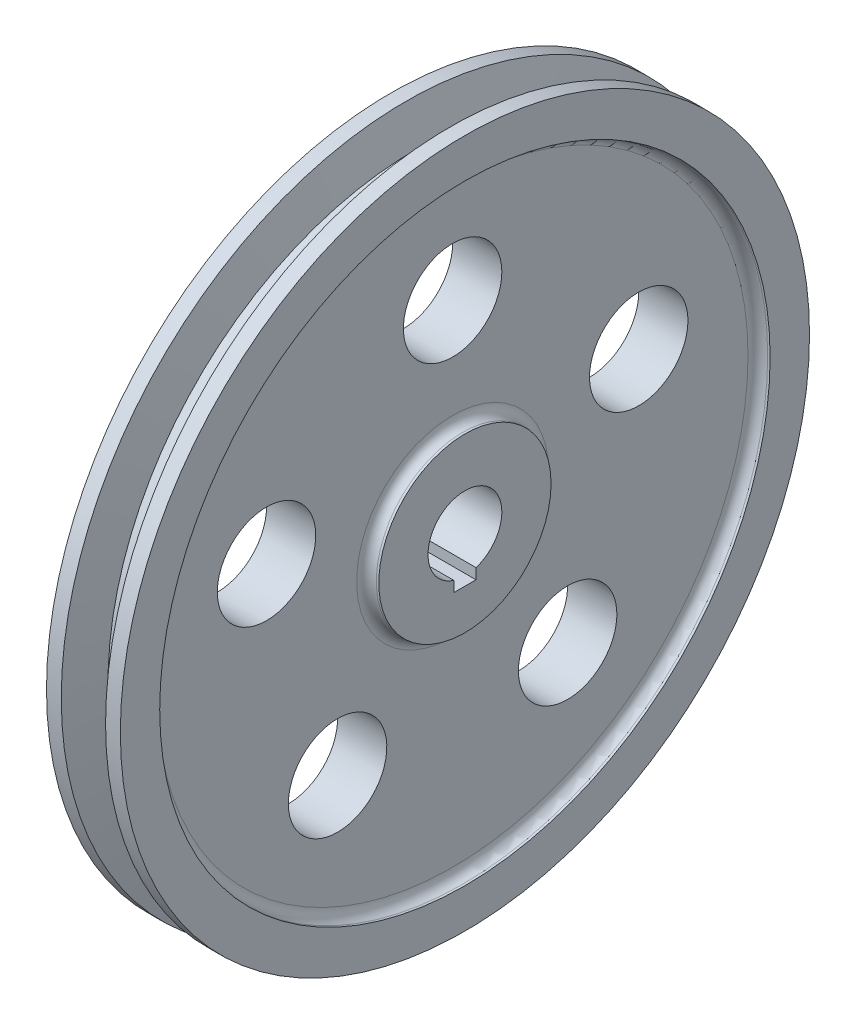
ISO-10303-21;
HEADER;
FILE_DESCRIPTION(('STEP AP214'),'2;1');
FILE_NAME('part.step','',(''),(''),'','','');
FILE_SCHEMA(('AUTOMOTIVE_DESIGN { 1 0 10303 214 1 1 1 1 }'));
ENDSEC;
DATA;
#1=APPLICATION_CONTEXT('core data for automotive mechanical design processes');
#2=APPLICATION_PROTOCOL_DEFINITION('international standard','automotive_design',2000,#1);
#3=PRODUCT_CONTEXT('',#1,'mechanical');
#4=PRODUCT('Part','Part','',(#3));
#5=PRODUCT_RELATED_PRODUCT_CATEGORY('part','',(#4));
#6=PRODUCT_DEFINITION_FORMATION('','',#4);
#7=PRODUCT_DEFINITION_CONTEXT('part definition',#1,'design');
#8=PRODUCT_DEFINITION('design','',#6,#7);
#9=PRODUCT_DEFINITION_SHAPE('','',#8);
#10=(LENGTH_UNIT() NAMED_UNIT(*) SI_UNIT(.MILLI.,.METRE.));
#11=(NAMED_UNIT(*) PLANE_ANGLE_UNIT() SI_UNIT($,.RADIAN.));
#12=(NAMED_UNIT(*) SI_UNIT($,.STERADIAN.) SOLID_ANGLE_UNIT());
#13=UNCERTAINTY_MEASURE_WITH_UNIT(LENGTH_MEASURE(1.E-05),#10,'distance_accuracy_value','');
#14=(GEOMETRIC_REPRESENTATION_CONTEXT(3) GLOBAL_UNCERTAINTY_ASSIGNED_CONTEXT((#13)) GLOBAL_UNIT_ASSIGNED_CONTEXT((#10,
#11,#12)) REPRESENTATION_CONTEXT('',''));
#15=CARTESIAN_POINT('',(0.,0.,0.));
#16=DIRECTION('',(0.,0.,1.));
#17=DIRECTION('',(1.,0.,0.));
#18=AXIS2_PLACEMENT_3D('',#15,#16,#17);
#19=CARTESIAN_POINT('',(-7.5,7.5,0.));
#20=DIRECTION('',(-1.,0.,0.));
#21=DIRECTION('',(0.,0.,1.));
#22=AXIS2_PLACEMENT_3D('',#19,#20,#21);
#23=PLANE('',#22);
#24=DIRECTION('',(0.,-1.,0.));
#25=VECTOR('',#24,1.);
#26=CARTESIAN_POINT('',(-7.5,-7.,2.25));
#27=LINE('',#26,#25);
#28=CARTESIAN_POINT('',(-7.5,-7.15454401062709,2.25));
#29=VERTEX_POINT('',#28);
#30=CARTESIAN_POINT('',(-7.5,-9.3,2.25));
#31=VERTEX_POINT('',#30);
#32=EDGE_CURVE('E51',#29,#31,#27,.T.);
#33=ORIENTED_EDGE('',*,*,#32,.T.);
#34=DIRECTION('',(0.,0.,-1.));
#35=VECTOR('',#34,1.);
#36=CARTESIAN_POINT('',(-7.5,-9.3,2.25));
#37=LINE('',#36,#35);
#38=CARTESIAN_POINT('',(-7.5,-9.3,-2.25));
#39=VERTEX_POINT('',#38);
#40=EDGE_CURVE('E75',#31,#39,#37,.T.);
#41=ORIENTED_EDGE('',*,*,#40,.T.);
#42=DIRECTION('',(0.,1.,0.));
#43=VECTOR('',#42,1.);
#44=CARTESIAN_POINT('',(-7.5,-7.,-2.25));
#45=LINE('',#44,#43);
#46=CARTESIAN_POINT('',(-7.5,-7.15454401062709,-2.25));
#47=VERTEX_POINT('',#46);
#48=EDGE_CURVE('E72',#39,#47,#45,.T.);
#49=ORIENTED_EDGE('',*,*,#48,.T.);
#50=CARTESIAN_POINT('',(-7.5,0.,0.));
#51=DIRECTION('',(1.,0.,0.));
#52=DIRECTION('',(0.,0.,-1.));
#53=AXIS2_PLACEMENT_3D('',#50,#51,#52);
#54=CIRCLE('',#53,7.5);
#55=EDGE_CURVE('E38',#47,#29,#54,.T.);
#56=ORIENTED_EDGE('',*,*,#55,.T.);
#57=EDGE_LOOP('',(#33,#41,#49,#56));
#58=FACE_BOUND('',#57,.T.);
#59=CARTESIAN_POINT('',(-7.5,0.,0.));
#60=DIRECTION('',(1.,0.,0.));
#61=DIRECTION('',(0.,0.,-1.));
#62=AXIS2_PLACEMENT_3D('',#59,#60,#61);
#63=CIRCLE('',#62,17.5);
#64=CARTESIAN_POINT('',(-7.5,0.,-17.5));
#65=VERTEX_POINT('',#64);
#66=EDGE_CURVE('E124',#65,#65,#63,.T.);
#67=ORIENTED_EDGE('',*,*,#66,.F.);
#68=EDGE_LOOP('',(#67));
#69=FACE_BOUND('',#68,.T.);
#70=ADVANCED_FACE('F31',(#58,#69),#23,.T.);
#71=CARTESIAN_POINT('',(25.8640372963672,0.,0.));
#72=DIRECTION('',(1.,0.,0.));
#73=DIRECTION('',(0.,0.,-1.));
#74=AXIS2_PLACEMENT_3D('',#71,#72,#73);
#75=CYLINDRICAL_SURFACE('',#74,7.5);
#76=DIRECTION('',(1.,0.,0.));
#77=VECTOR('',#76,1.);
#78=CARTESIAN_POINT('',(25.8640372963672,-7.15454401062709,2.25));
#79=LINE('',#78,#77);
#80=CARTESIAN_POINT('',(7.5,-7.15454401062709,2.25));
#81=VERTEX_POINT('',#80);
#82=EDGE_CURVE('E94',#29,#81,#79,.T.);
#83=ORIENTED_EDGE('',*,*,#82,.F.);
#84=ORIENTED_EDGE('',*,*,#55,.F.);
#85=DIRECTION('',(1.,0.,0.));
#86=VECTOR('',#85,1.);
#87=CARTESIAN_POINT('',(25.8640372963672,-7.15454401062709,-2.25));
#88=LINE('',#87,#86);
#89=CARTESIAN_POINT('',(7.5,-7.15454401062709,-2.25));
#90=VERTEX_POINT('',#89);
#91=EDGE_CURVE('E91',#90,#47,#88,.F.);
#92=ORIENTED_EDGE('',*,*,#91,.F.);
#93=CARTESIAN_POINT('',(7.5,0.,0.));
#94=DIRECTION('',(1.,0.,0.));
#95=DIRECTION('',(0.,0.,-1.));
#96=AXIS2_PLACEMENT_3D('',#93,#94,#95);
#97=CIRCLE('',#96,7.5);
#98=EDGE_CURVE('E180',#90,#81,#97,.T.);
#99=ORIENTED_EDGE('',*,*,#98,.T.);
#100=EDGE_LOOP('',(#83,#84,#92,#99));
#101=FACE_BOUND('',#100,.T.);
#102=ADVANCED_FACE('F185',(#101),#75,.F.);
#103=CARTESIAN_POINT('',(7.5,7.5,0.));
#104=DIRECTION('',(1.,0.,0.));
#105=DIRECTION('',(0.,0.,-1.));
#106=AXIS2_PLACEMENT_3D('',#103,#104,#105);
#107=PLANE('',#106);
#108=DIRECTION('',(0.,-1.,0.));
#109=VECTOR('',#108,1.);
#110=CARTESIAN_POINT('',(7.5,7.5,2.25));
#111=LINE('',#110,#109);
#112=CARTESIAN_POINT('',(7.5,-9.3,2.25));
#113=VERTEX_POINT('',#112);
#114=EDGE_CURVE('E11',#81,#113,#111,.T.);
#115=ORIENTED_EDGE('',*,*,#114,.F.);
#116=ORIENTED_EDGE('',*,*,#98,.F.);
#117=DIRECTION('',(0.,1.,0.));
#118=VECTOR('',#117,1.);
#119=CARTESIAN_POINT('',(7.5,-7.,-2.25));
#120=LINE('',#119,#118);
#121=CARTESIAN_POINT('',(7.5,-9.3,-2.25));
#122=VERTEX_POINT('',#121);
#123=EDGE_CURVE('E84',#122,#90,#120,.T.);
#124=ORIENTED_EDGE('',*,*,#123,.F.);
#125=DIRECTION('',(0.,0.,-1.));
#126=VECTOR('',#125,1.);
#127=CARTESIAN_POINT('',(7.5,-9.3,2.25));
#128=LINE('',#127,#126);
#129=EDGE_CURVE('E86',#113,#122,#128,.T.);
#130=ORIENTED_EDGE('',*,*,#129,.F.);
#131=EDGE_LOOP('',(#115,#116,#124,#130));
#132=FACE_BOUND('',#131,.T.);
#133=CARTESIAN_POINT('',(7.5,0.,0.));
#134=DIRECTION('',(1.,0.,0.));
#135=DIRECTION('',(0.,0.,-1.));
#136=AXIS2_PLACEMENT_3D('',#133,#134,#135);
#137=CIRCLE('',#136,17.5);
#138=CARTESIAN_POINT('',(7.5,0.,-17.5));
#139=VERTEX_POINT('',#138);
#140=EDGE_CURVE('E177',#139,#139,#137,.T.);
#141=ORIENTED_EDGE('',*,*,#140,.T.);
#142=EDGE_LOOP('',(#141));
#143=FACE_BOUND('',#142,.T.);
#144=ADVANCED_FACE('F188',(#132,#143),#107,.T.);
#145=CARTESIAN_POINT('',(25.8640372963672,0.,0.));
#146=DIRECTION('',(1.,0.,0.));
#147=DIRECTION('',(0.,0.,-1.));
#148=AXIS2_PLACEMENT_3D('',#145,#146,#147);
#149=CYLINDRICAL_SURFACE('',#148,17.5);
#150=CARTESIAN_POINT('',(7.,0.,0.));
#151=DIRECTION('',(1.,0.,0.));
#152=DIRECTION('',(0.,0.,-1.));
#153=AXIS2_PLACEMENT_3D('',#150,#151,#152);
#154=CIRCLE('',#153,17.5);
#155=CARTESIAN_POINT('',(7.,0.,-17.5));
#156=VERTEX_POINT('',#155);
#157=EDGE_CURVE('E174',#156,#156,#154,.T.);
#158=ORIENTED_EDGE('',*,*,#157,.T.);
#159=EDGE_LOOP('',(#158));
#160=FACE_BOUND('',#159,.T.);
#161=ORIENTED_EDGE('',*,*,#140,.F.);
#162=EDGE_LOOP('',(#161));
#163=FACE_BOUND('',#162,.T.);
#164=ADVANCED_FACE('F208',(#160,#163),#149,.T.);
#165=CARTESIAN_POINT('',(7.,0.,0.));
#166=DIRECTION('',(1.,0.,0.));
#167=DIRECTION('',(0.,0.,-1.));
#168=AXIS2_PLACEMENT_3D('',#165,#166,#167);
#169=TOROIDAL_SURFACE('',#168,19.5,2.);
#170=CARTESIAN_POINT('',(5.,0.,0.));
#171=DIRECTION('',(1.,0.,0.));
#172=DIRECTION('',(0.,0.,-1.));
#173=AXIS2_PLACEMENT_3D('',#170,#171,#172);
#174=CIRCLE('',#173,19.5);
#175=CARTESIAN_POINT('',(5.,0.,-19.5));
#176=VERTEX_POINT('',#175);
#177=EDGE_CURVE('E171',#176,#176,#174,.T.);
#178=ORIENTED_EDGE('',*,*,#177,.T.);
#179=EDGE_LOOP('',(#178));
#180=FACE_BOUND('',#179,.T.);
#181=ORIENTED_EDGE('',*,*,#157,.F.);
#182=EDGE_LOOP('',(#181));
#183=FACE_BOUND('',#182,.T.);
#184=ADVANCED_FACE('F213',(#180,#183),#169,.F.);
#185=CARTESIAN_POINT('',(5.,19.5,0.));
#186=DIRECTION('',(1.,0.,0.));
#187=DIRECTION('',(0.,0.,-1.));
#188=AXIS2_PLACEMENT_3D('',#185,#186,#187);
#189=PLANE('',#188);
#190=CARTESIAN_POINT('',(5.,12.2834255264046,37.8044965227322));
#191=DIRECTION('',(1.,0.,0.));
#192=DIRECTION('',(0.,0.95105651629515,-0.309016994374958));
#193=AXIS2_PLACEMENT_3D('',#190,#191,#192);
#194=CIRCLE('',#193,10.);
#195=CARTESIAN_POINT('',(5.,21.7939906893561,34.7143265789826));
#196=VERTEX_POINT('',#195);
#197=EDGE_CURVE('E96',#196,#196,#194,.T.);
#198=ORIENTED_EDGE('',*,*,#197,.F.);
#199=EDGE_LOOP('',(#198));
#200=FACE_BOUND('',#199,.T.);
#201=CARTESIAN_POINT('',(5.,-32.158425526404,23.3644637786261));
#202=DIRECTION('',(1.,0.,0.));
#203=DIRECTION('',(0.,0.58778525229248,0.809016994374942));
#204=AXIS2_PLACEMENT_3D('',#201,#202,#203);
#205=CIRCLE('',#204,10.);
#206=CARTESIAN_POINT('',(5.,-26.2805730034792,31.4546337223755));
#207=VERTEX_POINT('',#206);
#208=EDGE_CURVE('E100',#207,#207,#205,.T.);
#209=ORIENTED_EDGE('',*,*,#208,.F.);
#210=EDGE_LOOP('',(#209));
#211=FACE_BOUND('',#210,.T.);
#212=CARTESIAN_POINT('',(5.,-32.1584255264043,-23.3644637786256));
#213=DIRECTION('',(1.,0.,0.));
#214=DIRECTION('',(0.,-0.587785252292469,0.809016994374951));
#215=AXIS2_PLACEMENT_3D('',#212,#213,#214);
#216=CIRCLE('',#215,10.);
#217=CARTESIAN_POINT('',(5.,-38.036278049329,-15.2742938348761));
#218=VERTEX_POINT('',#217);
#219=EDGE_CURVE('E106',#218,#218,#216,.T.);
#220=ORIENTED_EDGE('',*,*,#219,.F.);
#221=EDGE_LOOP('',(#220));
#222=FACE_BOUND('',#221,.T.);
#223=CARTESIAN_POINT('',(5.,12.2834255264041,-37.8044965227324));
#224=DIRECTION('',(1.,0.,0.));
#225=DIRECTION('',(0.,-0.951056516295155,-0.309016994374945));
#226=AXIS2_PLACEMENT_3D('',#223,#224,#225);
#227=CIRCLE('',#226,10.);
#228=CARTESIAN_POINT('',(5.,2.7728603634525,-40.8946664664819));
#229=VERTEX_POINT('',#228);
#230=EDGE_CURVE('E112',#229,#229,#227,.T.);
#231=ORIENTED_EDGE('',*,*,#230,.F.);
#232=EDGE_LOOP('',(#231));
#233=FACE_BOUND('',#232,.T.);
#234=CARTESIAN_POINT('',(5.,39.75,0.));
#235=DIRECTION('',(1.,0.,0.));
#236=DIRECTION('',(0.,0.,-1.));
#237=AXIS2_PLACEMENT_3D('',#234,#235,#236);
#238=CIRCLE('',#237,10.);
#239=CARTESIAN_POINT('',(5.,39.75,-10.));
#240=VERTEX_POINT('',#239);
#241=EDGE_CURVE('E118',#240,#240,#238,.T.);
#242=ORIENTED_EDGE('',*,*,#241,.F.);
#243=EDGE_LOOP('',(#242));
#244=FACE_BOUND('',#243,.T.);
#245=CARTESIAN_POINT('',(5.,0.,0.));
#246=DIRECTION('',(1.,0.,0.));
#247=DIRECTION('',(0.,0.,-1.));
#248=AXIS2_PLACEMENT_3D('',#245,#246,#247);
#249=CIRCLE('',#248,60.);
#250=CARTESIAN_POINT('',(5.,0.,-60.));
#251=VERTEX_POINT('',#250);
#252=EDGE_CURVE('E168',#251,#251,#249,.T.);
#253=ORIENTED_EDGE('',*,*,#252,.T.);
#254=EDGE_LOOP('',(#253));
#255=FACE_BOUND('',#254,.T.);
#256=ORIENTED_EDGE('',*,*,#177,.F.);
#257=EDGE_LOOP('',(#256));
#258=FACE_BOUND('',#257,.T.);
#259=ADVANCED_FACE('F217',(#200,#211,#222,#233,#244,#255,#258),#189,.T.);
#260=CARTESIAN_POINT('',(7.,0.,0.));
#261=DIRECTION('',(1.,0.,0.));
#262=DIRECTION('',(0.,0.,-1.));
#263=AXIS2_PLACEMENT_3D('',#260,#261,#262);
#264=TOROIDAL_SURFACE('',#263,60.,2.);
#265=CARTESIAN_POINT('',(7.,0.,0.));
#266=DIRECTION('',(1.,0.,0.));
#267=DIRECTION('',(0.,0.,-1.));
#268=AXIS2_PLACEMENT_3D('',#265,#266,#267);
#269=CIRCLE('',#268,62.);
#270=CARTESIAN_POINT('',(7.,0.,-62.));
#271=VERTEX_POINT('',#270);
#272=EDGE_CURVE('E165',#271,#271,#269,.T.);
#273=ORIENTED_EDGE('',*,*,#272,.T.);
#274=EDGE_LOOP('',(#273));
#275=FACE_BOUND('',#274,.T.);
#276=ORIENTED_EDGE('',*,*,#252,.F.);
#277=EDGE_LOOP('',(#276));
#278=FACE_BOUND('',#277,.T.);
#279=ADVANCED_FACE('F221',(#275,#278),#264,.F.);
#280=CARTESIAN_POINT('',(25.8640372963672,0.,0.));
#281=DIRECTION('',(1.,0.,0.));
#282=DIRECTION('',(0.,0.,-1.));
#283=AXIS2_PLACEMENT_3D('',#280,#281,#282);
#284=CYLINDRICAL_SURFACE('',#283,62.);
#285=CARTESIAN_POINT('',(7.5,0.,0.));
#286=DIRECTION('',(1.,0.,0.));
#287=DIRECTION('',(0.,0.,-1.));
#288=AXIS2_PLACEMENT_3D('',#285,#286,#287);
#289=CIRCLE('',#288,62.);
#290=CARTESIAN_POINT('',(7.5,0.,-62.));
#291=VERTEX_POINT('',#290);
#292=EDGE_CURVE('E162',#291,#291,#289,.T.);
#293=ORIENTED_EDGE('',*,*,#292,.T.);
#294=EDGE_LOOP('',(#293));
#295=FACE_BOUND('',#294,.T.);
#296=ORIENTED_EDGE('',*,*,#272,.F.);
#297=EDGE_LOOP('',(#296));
#298=FACE_BOUND('',#297,.T.);
#299=ADVANCED_FACE('F225',(#295,#298),#284,.F.);
#300=CARTESIAN_POINT('',(7.5,62.,0.));
#301=DIRECTION('',(1.,0.,0.));
#302=DIRECTION('',(0.,0.,-1.));
#303=AXIS2_PLACEMENT_3D('',#300,#301,#302);
#304=PLANE('',#303);
#305=CARTESIAN_POINT('',(7.5,0.,0.));
#306=DIRECTION('',(1.,0.,0.));
#307=DIRECTION('',(0.,0.,-1.));
#308=AXIS2_PLACEMENT_3D('',#305,#306,#307);
#309=CIRCLE('',#308,70.);
#310=CARTESIAN_POINT('',(7.5,0.,-70.));
#311=VERTEX_POINT('',#310);
#312=EDGE_CURVE('E159',#311,#311,#309,.T.);
#313=ORIENTED_EDGE('',*,*,#312,.T.);
#314=EDGE_LOOP('',(#313));
#315=FACE_BOUND('',#314,.T.);
#316=ORIENTED_EDGE('',*,*,#292,.F.);
#317=EDGE_LOOP('',(#316));
#318=FACE_BOUND('',#317,.T.);
#319=ADVANCED_FACE('F229',(#315,#318),#304,.T.);
#320=CARTESIAN_POINT('',(25.8640372963672,0.,0.));
#321=DIRECTION('',(1.,0.,0.));
#322=DIRECTION('',(0.,0.,-1.));
#323=AXIS2_PLACEMENT_3D('',#320,#321,#322);
#324=CYLINDRICAL_SURFACE('',#323,70.);
#325=CARTESIAN_POINT('',(4.5,0.,0.));
#326=DIRECTION('',(1.,0.,0.));
#327=DIRECTION('',(0.,0.,-1.));
#328=AXIS2_PLACEMENT_3D('',#325,#326,#327);
#329=CIRCLE('',#328,70.);
#330=CARTESIAN_POINT('',(4.5,0.,-70.));
#331=VERTEX_POINT('',#330);
#332=EDGE_CURVE('E156',#331,#331,#329,.T.);
#333=ORIENTED_EDGE('',*,*,#332,.T.);
#334=EDGE_LOOP('',(#333));
#335=FACE_BOUND('',#334,.T.);
#336=ORIENTED_EDGE('',*,*,#312,.F.);
#337=EDGE_LOOP('',(#336));
#338=FACE_BOUND('',#337,.T.);
#339=ADVANCED_FACE('F233',(#335,#338),#324,.T.);
#340=CARTESIAN_POINT('',(4.5,0.,0.));
#341=DIRECTION('',(1.,0.,0.));
#342=DIRECTION('',(0.,0.,-1.));
#343=AXIS2_PLACEMENT_3D('',#340,#341,#342);
#344=CONICAL_SURFACE('',#343,70.,1.31019393504756);
#345=CARTESIAN_POINT('',(2.5,0.,0.));
#346=DIRECTION('',(1.,0.,0.));
#347=DIRECTION('',(0.,0.,-1.));
#348=AXIS2_PLACEMENT_3D('',#345,#346,#347);
#349=CIRCLE('',#348,62.5);
#350=CARTESIAN_POINT('',(2.5,0.,-62.5));
#351=VERTEX_POINT('',#350);
#352=EDGE_CURVE('E153',#351,#351,#349,.T.);
#353=ORIENTED_EDGE('',*,*,#352,.T.);
#354=EDGE_LOOP('',(#353));
#355=FACE_BOUND('',#354,.T.);
#356=ORIENTED_EDGE('',*,*,#332,.F.);
#357=EDGE_LOOP('',(#356));
#358=FACE_BOUND('',#357,.T.);
#359=ADVANCED_FACE('F237',(#355,#358),#344,.T.);
#360=CARTESIAN_POINT('',(25.8640372963672,0.,0.));
#361=DIRECTION('',(1.,0.,0.));
#362=DIRECTION('',(0.,0.,-1.));
#363=AXIS2_PLACEMENT_3D('',#360,#361,#362);
#364=CYLINDRICAL_SURFACE('',#363,62.5);
#365=CARTESIAN_POINT('',(-2.5,0.,0.));
#366=DIRECTION('',(1.,0.,0.));
#367=DIRECTION('',(0.,0.,-1.));
#368=AXIS2_PLACEMENT_3D('',#365,#366,#367);
#369=CIRCLE('',#368,62.5);
#370=CARTESIAN_POINT('',(-2.5,0.,-62.5));
#371=VERTEX_POINT('',#370);
#372=EDGE_CURVE('E150',#371,#371,#369,.T.);
#373=ORIENTED_EDGE('',*,*,#372,.T.);
#374=EDGE_LOOP('',(#373));
#375=FACE_BOUND('',#374,.T.);
#376=ORIENTED_EDGE('',*,*,#352,.F.);
#377=EDGE_LOOP('',(#376));
#378=FACE_BOUND('',#377,.T.);
#379=ADVANCED_FACE('F241',(#375,#378),#364,.T.);
#380=CARTESIAN_POINT('',(-2.5,0.,0.));
#381=DIRECTION('',(-1.,0.,0.));
#382=DIRECTION('',(0.,0.,1.));
#383=AXIS2_PLACEMENT_3D('',#380,#381,#382);
#384=CONICAL_SURFACE('',#383,62.5,1.31019393504756);
#385=CARTESIAN_POINT('',(-4.5,0.,0.));
#386=DIRECTION('',(1.,0.,0.));
#387=DIRECTION('',(0.,0.,-1.));
#388=AXIS2_PLACEMENT_3D('',#385,#386,#387);
#389=CIRCLE('',#388,70.);
#390=CARTESIAN_POINT('',(-4.5,0.,-70.));
#391=VERTEX_POINT('',#390);
#392=EDGE_CURVE('E147',#391,#391,#389,.T.);
#393=ORIENTED_EDGE('',*,*,#392,.T.);
#394=EDGE_LOOP('',(#393));
#395=FACE_BOUND('',#394,.T.);
#396=ORIENTED_EDGE('',*,*,#372,.F.);
#397=EDGE_LOOP('',(#396));
#398=FACE_BOUND('',#397,.T.);
#399=ADVANCED_FACE('F245',(#395,#398),#384,.T.);
#400=CARTESIAN_POINT('',(25.8640372963672,0.,0.));
#401=DIRECTION('',(1.,0.,0.));
#402=DIRECTION('',(0.,0.,-1.));
#403=AXIS2_PLACEMENT_3D('',#400,#401,#402);
#404=CYLINDRICAL_SURFACE('',#403,70.);
#405=CARTESIAN_POINT('',(-7.5,0.,0.));
#406=DIRECTION('',(1.,0.,0.));
#407=DIRECTION('',(0.,0.,-1.));
#408=AXIS2_PLACEMENT_3D('',#405,#406,#407);
#409=CIRCLE('',#408,70.);
#410=CARTESIAN_POINT('',(-7.5,0.,-70.));
#411=VERTEX_POINT('',#410);
#412=EDGE_CURVE('E144',#411,#411,#409,.T.);
#413=ORIENTED_EDGE('',*,*,#412,.T.);
#414=EDGE_LOOP('',(#413));
#415=FACE_BOUND('',#414,.T.);
#416=ORIENTED_EDGE('',*,*,#392,.F.);
#417=EDGE_LOOP('',(#416));
#418=FACE_BOUND('',#417,.T.);
#419=ADVANCED_FACE('F249',(#415,#418),#404,.T.);
#420=CARTESIAN_POINT('',(-7.5,62.,0.));
#421=DIRECTION('',(-1.,0.,0.));
#422=DIRECTION('',(0.,0.,1.));
#423=AXIS2_PLACEMENT_3D('',#420,#421,#422);
#424=PLANE('',#423);
#425=CARTESIAN_POINT('',(-7.5,0.,0.));
#426=DIRECTION('',(1.,0.,0.));
#427=DIRECTION('',(0.,0.,-1.));
#428=AXIS2_PLACEMENT_3D('',#425,#426,#427);
#429=CIRCLE('',#428,62.);
#430=CARTESIAN_POINT('',(-7.5,0.,-62.));
#431=VERTEX_POINT('',#430);
#432=EDGE_CURVE('E141',#431,#431,#429,.T.);
#433=ORIENTED_EDGE('',*,*,#432,.T.);
#434=EDGE_LOOP('',(#433));
#435=FACE_BOUND('',#434,.T.);
#436=ORIENTED_EDGE('',*,*,#412,.F.);
#437=EDGE_LOOP('',(#436));
#438=FACE_BOUND('',#437,.T.);
#439=ADVANCED_FACE('F253',(#435,#438),#424,.T.);
#440=CARTESIAN_POINT('',(25.8640372963672,0.,0.));
#441=DIRECTION('',(1.,0.,0.));
#442=DIRECTION('',(0.,0.,-1.));
#443=AXIS2_PLACEMENT_3D('',#440,#441,#442);
#444=CYLINDRICAL_SURFACE('',#443,62.);
#445=CARTESIAN_POINT('',(-7.,0.,0.));
#446=DIRECTION('',(1.,0.,0.));
#447=DIRECTION('',(0.,0.,-1.));
#448=AXIS2_PLACEMENT_3D('',#445,#446,#447);
#449=CIRCLE('',#448,62.);
#450=CARTESIAN_POINT('',(-7.,0.,-62.));
#451=VERTEX_POINT('',#450);
#452=EDGE_CURVE('E138',#451,#451,#449,.T.);
#453=ORIENTED_EDGE('',*,*,#452,.T.);
#454=EDGE_LOOP('',(#453));
#455=FACE_BOUND('',#454,.T.);
#456=ORIENTED_EDGE('',*,*,#432,.F.);
#457=EDGE_LOOP('',(#456));
#458=FACE_BOUND('',#457,.T.);
#459=ADVANCED_FACE('F257',(#455,#458),#444,.F.);
#460=CARTESIAN_POINT('',(-7.,0.,0.));
#461=DIRECTION('',(1.,0.,0.));
#462=DIRECTION('',(0.,0.,-1.));
#463=AXIS2_PLACEMENT_3D('',#460,#461,#462);
#464=TOROIDAL_SURFACE('',#463,60.,2.);
#465=CARTESIAN_POINT('',(-5.,0.,0.));
#466=DIRECTION('',(1.,0.,0.));
#467=DIRECTION('',(0.,0.,-1.));
#468=AXIS2_PLACEMENT_3D('',#465,#466,#467);
#469=CIRCLE('',#468,60.);
#470=CARTESIAN_POINT('',(-5.,0.,-60.));
#471=VERTEX_POINT('',#470);
#472=EDGE_CURVE('E135',#471,#471,#469,.T.);
#473=ORIENTED_EDGE('',*,*,#472,.T.);
#474=EDGE_LOOP('',(#473));
#475=FACE_BOUND('',#474,.T.);
#476=ORIENTED_EDGE('',*,*,#452,.F.);
#477=EDGE_LOOP('',(#476));
#478=FACE_BOUND('',#477,.T.);
#479=ADVANCED_FACE('F261',(#475,#478),#464,.F.);
#480=CARTESIAN_POINT('',(-5.,19.5,0.));
#481=DIRECTION('',(-1.,0.,0.));
#482=DIRECTION('',(0.,0.,1.));
#483=AXIS2_PLACEMENT_3D('',#480,#481,#482);
#484=PLANE('',#483);
#485=CARTESIAN_POINT('',(-5.,12.2834255264046,37.8044965227322));
#486=DIRECTION('',(1.,0.,0.));
#487=DIRECTION('',(0.,0.95105651629515,-0.309016994374958));
#488=AXIS2_PLACEMENT_3D('',#485,#486,#487);
#489=CIRCLE('',#488,10.);
#490=CARTESIAN_POINT('',(-5.,21.7939906893561,34.7143265789826));
#491=VERTEX_POINT('',#490);
#492=EDGE_CURVE('E97',#491,#491,#489,.T.);
#493=ORIENTED_EDGE('',*,*,#492,.T.);
#494=EDGE_LOOP('',(#493));
#495=FACE_BOUND('',#494,.T.);
#496=CARTESIAN_POINT('',(-5.,-32.158425526404,23.3644637786261));
#497=DIRECTION('',(1.,0.,0.));
#498=DIRECTION('',(0.,0.58778525229248,0.809016994374942));
#499=AXIS2_PLACEMENT_3D('',#496,#497,#498);
#500=CIRCLE('',#499,10.);
#501=CARTESIAN_POINT('',(-5.,-26.2805730034792,31.4546337223755));
#502=VERTEX_POINT('',#501);
#503=EDGE_CURVE('E103',#502,#502,#500,.T.);
#504=ORIENTED_EDGE('',*,*,#503,.T.);
#505=EDGE_LOOP('',(#504));
#506=FACE_BOUND('',#505,.T.);
#507=CARTESIAN_POINT('',(-5.,-32.1584255264043,-23.3644637786256));
#508=DIRECTION('',(1.,0.,0.));
#509=DIRECTION('',(0.,-0.587785252292469,0.809016994374951));
#510=AXIS2_PLACEMENT_3D('',#507,#508,#509);
#511=CIRCLE('',#510,10.);
#512=CARTESIAN_POINT('',(-5.,-38.036278049329,-15.2742938348761));
#513=VERTEX_POINT('',#512);
#514=EDGE_CURVE('E109',#513,#513,#511,.T.);
#515=ORIENTED_EDGE('',*,*,#514,.T.);
#516=EDGE_LOOP('',(#515));
#517=FACE_BOUND('',#516,.T.);
#518=CARTESIAN_POINT('',(-5.,12.2834255264041,-37.8044965227324));
#519=DIRECTION('',(1.,0.,0.));
#520=DIRECTION('',(0.,-0.951056516295155,-0.309016994374945));
#521=AXIS2_PLACEMENT_3D('',#518,#519,#520);
#522=CIRCLE('',#521,10.);
#523=CARTESIAN_POINT('',(-5.,2.7728603634525,-40.8946664664819));
#524=VERTEX_POINT('',#523);
#525=EDGE_CURVE('E115',#524,#524,#522,.T.);
#526=ORIENTED_EDGE('',*,*,#525,.T.);
#527=EDGE_LOOP('',(#526));
#528=FACE_BOUND('',#527,.T.);
#529=CARTESIAN_POINT('',(-5.,39.75,0.));
#530=DIRECTION('',(1.,0.,0.));
#531=DIRECTION('',(0.,0.,-1.));
#532=AXIS2_PLACEMENT_3D('',#529,#530,#531);
#533=CIRCLE('',#532,10.);
#534=CARTESIAN_POINT('',(-5.,39.75,-10.));
#535=VERTEX_POINT('',#534);
#536=EDGE_CURVE('E121',#535,#535,#533,.T.);
#537=ORIENTED_EDGE('',*,*,#536,.T.);
#538=EDGE_LOOP('',(#537));
#539=FACE_BOUND('',#538,.T.);
#540=CARTESIAN_POINT('',(-5.,0.,0.));
#541=DIRECTION('',(1.,0.,0.));
#542=DIRECTION('',(0.,0.,-1.));
#543=AXIS2_PLACEMENT_3D('',#540,#541,#542);
#544=CIRCLE('',#543,19.5);
#545=CARTESIAN_POINT('',(-5.,0.,-19.5));
#546=VERTEX_POINT('',#545);
#547=EDGE_CURVE('E132',#546,#546,#544,.T.);
#548=ORIENTED_EDGE('',*,*,#547,.T.);
#549=EDGE_LOOP('',(#548));
#550=FACE_BOUND('',#549,.T.);
#551=ORIENTED_EDGE('',*,*,#472,.F.);
#552=EDGE_LOOP('',(#551));
#553=FACE_BOUND('',#552,.T.);
#554=ADVANCED_FACE('F265',(#495,#506,#517,#528,#539,#550,#553),#484,.T.);
#555=CARTESIAN_POINT('',(-7.,0.,0.));
#556=DIRECTION('',(1.,0.,0.));
#557=DIRECTION('',(0.,0.,-1.));
#558=AXIS2_PLACEMENT_3D('',#555,#556,#557);
#559=TOROIDAL_SURFACE('',#558,19.5,2.);
#560=CARTESIAN_POINT('',(-7.,0.,0.));
#561=DIRECTION('',(1.,0.,0.));
#562=DIRECTION('',(0.,0.,-1.));
#563=AXIS2_PLACEMENT_3D('',#560,#561,#562);
#564=CIRCLE('',#563,17.5);
#565=CARTESIAN_POINT('',(-7.,0.,-17.5));
#566=VERTEX_POINT('',#565);
#567=EDGE_CURVE('E129',#566,#566,#564,.T.);
#568=ORIENTED_EDGE('',*,*,#567,.T.);
#569=EDGE_LOOP('',(#568));
#570=FACE_BOUND('',#569,.T.);
#571=ORIENTED_EDGE('',*,*,#547,.F.);
#572=EDGE_LOOP('',(#571));
#573=FACE_BOUND('',#572,.T.);
#574=ADVANCED_FACE('F269',(#570,#573),#559,.F.);
#575=CARTESIAN_POINT('',(25.8640372963672,0.,0.));
#576=DIRECTION('',(1.,0.,0.));
#577=DIRECTION('',(0.,0.,-1.));
#578=AXIS2_PLACEMENT_3D('',#575,#576,#577);
#579=CYLINDRICAL_SURFACE('',#578,17.5);
#580=ORIENTED_EDGE('',*,*,#66,.T.);
#581=EDGE_LOOP('',(#580));
#582=FACE_BOUND('',#581,.T.);
#583=ORIENTED_EDGE('',*,*,#567,.F.);
#584=EDGE_LOOP('',(#583));
#585=FACE_BOUND('',#584,.T.);
#586=ADVANCED_FACE('F273',(#582,#585),#579,.T.);
#587=CARTESIAN_POINT('',(-5.,39.75,0.));
#588=DIRECTION('',(1.,0.,0.));
#589=DIRECTION('',(0.,0.,-1.));
#590=AXIS2_PLACEMENT_3D('',#587,#588,#589);
#591=CYLINDRICAL_SURFACE('',#590,10.);
#592=ORIENTED_EDGE('',*,*,#536,.F.);
#593=EDGE_LOOP('',(#592));
#594=FACE_BOUND('',#593,.T.);
#595=ORIENTED_EDGE('',*,*,#241,.T.);
#596=EDGE_LOOP('',(#595));
#597=FACE_BOUND('',#596,.T.);
#598=ADVANCED_FACE('F277',(#594,#597),#591,.F.);
#599=CARTESIAN_POINT('',(-5.,12.2834255264041,-37.8044965227324));
#600=DIRECTION('',(1.,0.,0.));
#601=DIRECTION('',(0.,0.,-1.));
#602=AXIS2_PLACEMENT_3D('',#599,#600,#601);
#603=CYLINDRICAL_SURFACE('',#602,10.);
#604=ORIENTED_EDGE('',*,*,#525,.F.);
#605=EDGE_LOOP('',(#604));
#606=FACE_BOUND('',#605,.T.);
#607=ORIENTED_EDGE('',*,*,#230,.T.);
#608=EDGE_LOOP('',(#607));
#609=FACE_BOUND('',#608,.T.);
#610=ADVANCED_FACE('F281',(#606,#609),#603,.F.);
#611=CARTESIAN_POINT('',(-5.,-32.1584255264043,-23.3644637786256));
#612=DIRECTION('',(1.,0.,0.));
#613=DIRECTION('',(0.,0.,-1.));
#614=AXIS2_PLACEMENT_3D('',#611,#612,#613);
#615=CYLINDRICAL_SURFACE('',#614,10.);
#616=ORIENTED_EDGE('',*,*,#514,.F.);
#617=EDGE_LOOP('',(#616));
#618=FACE_BOUND('',#617,.T.);
#619=ORIENTED_EDGE('',*,*,#219,.T.);
#620=EDGE_LOOP('',(#619));
#621=FACE_BOUND('',#620,.T.);
#622=ADVANCED_FACE('F285',(#618,#621),#615,.F.);
#623=CARTESIAN_POINT('',(-5.,-32.158425526404,23.3644637786261));
#624=DIRECTION('',(1.,0.,0.));
#625=DIRECTION('',(0.,0.,-1.));
#626=AXIS2_PLACEMENT_3D('',#623,#624,#625);
#627=CYLINDRICAL_SURFACE('',#626,10.);
#628=ORIENTED_EDGE('',*,*,#503,.F.);
#629=EDGE_LOOP('',(#628));
#630=FACE_BOUND('',#629,.T.);
#631=ORIENTED_EDGE('',*,*,#208,.T.);
#632=EDGE_LOOP('',(#631));
#633=FACE_BOUND('',#632,.T.);
#634=ADVANCED_FACE('F289',(#630,#633),#627,.F.);
#635=CARTESIAN_POINT('',(-5.,12.2834255264046,37.8044965227322));
#636=DIRECTION('',(1.,0.,0.));
#637=DIRECTION('',(0.,0.,-1.));
#638=AXIS2_PLACEMENT_3D('',#635,#636,#637);
#639=CYLINDRICAL_SURFACE('',#638,10.);
#640=ORIENTED_EDGE('',*,*,#492,.F.);
#641=EDGE_LOOP('',(#640));
#642=FACE_BOUND('',#641,.T.);
#643=ORIENTED_EDGE('',*,*,#197,.T.);
#644=EDGE_LOOP('',(#643));
#645=FACE_BOUND('',#644,.T.);
#646=ADVANCED_FACE('F199',(#642,#645),#639,.F.);
#647=CARTESIAN_POINT('',(-7.5,-7.,2.25));
#648=DIRECTION('',(0.,0.,1.));
#649=DIRECTION('',(1.,0.,0.));
#650=AXIS2_PLACEMENT_3D('',#647,#648,#649);
#651=PLANE('',#650);
#652=ORIENTED_EDGE('',*,*,#82,.T.);
#653=ORIENTED_EDGE('',*,*,#114,.T.);
#654=DIRECTION('',(1.,0.,0.));
#655=VECTOR('',#654,1.);
#656=CARTESIAN_POINT('',(-7.5,-9.3,2.25));
#657=LINE('',#656,#655);
#658=EDGE_CURVE('E45',#31,#113,#657,.T.);
#659=ORIENTED_EDGE('',*,*,#658,.F.);
#660=ORIENTED_EDGE('',*,*,#32,.F.);
#661=EDGE_LOOP('',(#652,#653,#659,#660));
#662=FACE_BOUND('',#661,.T.);
#663=ADVANCED_FACE('F68',(#662),#651,.F.);
#664=CARTESIAN_POINT('',(-7.5,-7.,-2.25));
#665=DIRECTION('',(0.,0.,-1.));
#666=DIRECTION('',(-1.,0.,0.));
#667=AXIS2_PLACEMENT_3D('',#664,#665,#666);
#668=PLANE('',#667);
#669=ORIENTED_EDGE('',*,*,#91,.T.);
#670=ORIENTED_EDGE('',*,*,#48,.F.);
#671=DIRECTION('',(1.,0.,0.));
#672=VECTOR('',#671,1.);
#673=CARTESIAN_POINT('',(-7.5,-9.3,-2.25));
#674=LINE('',#673,#672);
#675=EDGE_CURVE('E71',#39,#122,#674,.T.);
#676=ORIENTED_EDGE('',*,*,#675,.T.);
#677=ORIENTED_EDGE('',*,*,#123,.T.);
#678=EDGE_LOOP('',(#669,#670,#676,#677));
#679=FACE_BOUND('',#678,.T.);
#680=ADVANCED_FACE('F191',(#679),#668,.F.);
#681=CARTESIAN_POINT('',(-7.5,-9.3,2.25));
#682=DIRECTION('',(0.,-1.,0.));
#683=DIRECTION('',(0.,0.,-1.));
#684=AXIS2_PLACEMENT_3D('',#681,#682,#683);
#685=PLANE('',#684);
#686=ORIENTED_EDGE('',*,*,#129,.T.);
#687=ORIENTED_EDGE('',*,*,#675,.F.);
#688=ORIENTED_EDGE('',*,*,#40,.F.);
#689=ORIENTED_EDGE('',*,*,#658,.T.);
#690=EDGE_LOOP('',(#686,#687,#688,#689));
#691=FACE_BOUND('',#690,.T.);
#692=ADVANCED_FACE('F76',(#691),#685,.F.);
#693=CLOSED_SHELL('',(#70,#102,#144,#164,#184,#259,#279,#299,#319,#339,#359,#379,#399,#419,#439,
#459,#479,#554,#574,#586,#598,#610,#622,#634,#646,#663,#680,#692));
#694=MANIFOLD_SOLID_BREP('B2',#693);
#695=ADVANCED_BREP_SHAPE_REPRESENTATION('',(#18,#694),#14);
#696=SHAPE_DEFINITION_REPRESENTATION(#9,#695);
ENDSEC;
END-ISO-10303-21;
